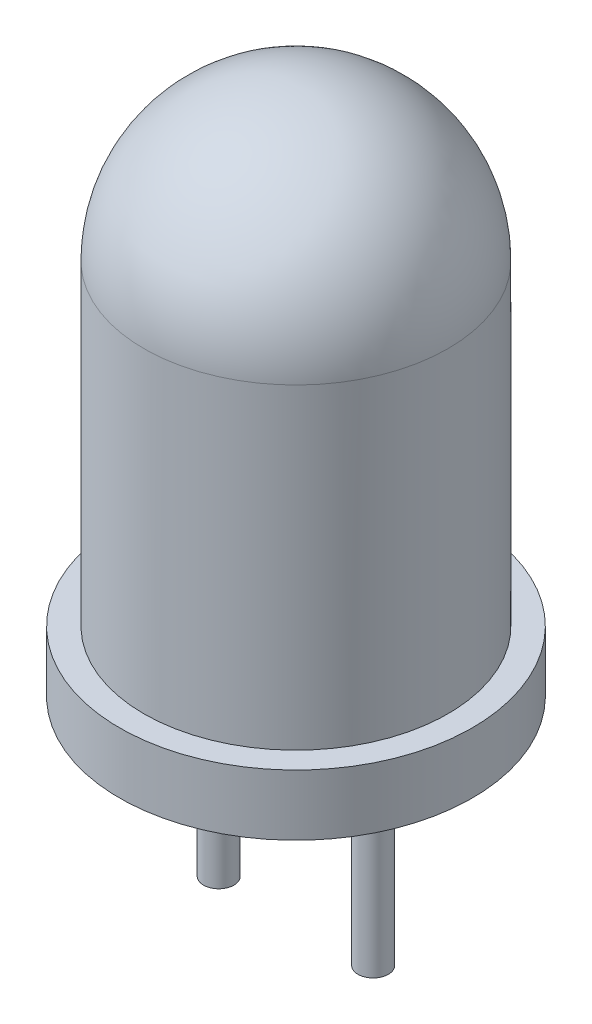
ISO-10303-21;
HEADER;
FILE_DESCRIPTION(('STEP AP214'),'2;1');
FILE_NAME('part.step','',(''),(''),'','','');
FILE_SCHEMA(('AUTOMOTIVE_DESIGN { 1 0 10303 214 1 1 1 1 }'));
ENDSEC;
DATA;
#1=APPLICATION_CONTEXT('core data for automotive mechanical design processes');
#2=APPLICATION_PROTOCOL_DEFINITION('international standard','automotive_design',2000,#1);
#3=PRODUCT_CONTEXT('',#1,'mechanical');
#4=PRODUCT('Part','Part','',(#3));
#5=PRODUCT_RELATED_PRODUCT_CATEGORY('part','',(#4));
#6=PRODUCT_DEFINITION_FORMATION('','',#4);
#7=PRODUCT_DEFINITION_CONTEXT('part definition',#1,'design');
#8=PRODUCT_DEFINITION('design','',#6,#7);
#9=PRODUCT_DEFINITION_SHAPE('','',#8);
#10=(LENGTH_UNIT() NAMED_UNIT(*) SI_UNIT(.MILLI.,.METRE.));
#11=(NAMED_UNIT(*) PLANE_ANGLE_UNIT() SI_UNIT($,.RADIAN.));
#12=(NAMED_UNIT(*) SI_UNIT($,.STERADIAN.) SOLID_ANGLE_UNIT());
#13=UNCERTAINTY_MEASURE_WITH_UNIT(LENGTH_MEASURE(1.E-05),#10,'distance_accuracy_value','');
#14=(GEOMETRIC_REPRESENTATION_CONTEXT(3) GLOBAL_UNCERTAINTY_ASSIGNED_CONTEXT((#13)) GLOBAL_UNIT_ASSIGNED_CONTEXT((#10,
#11,#12)) REPRESENTATION_CONTEXT('',''));
#15=CARTESIAN_POINT('',(0.,0.,0.));
#16=DIRECTION('',(0.,0.,1.));
#17=DIRECTION('',(1.,0.,0.));
#18=AXIS2_PLACEMENT_3D('',#15,#16,#17);
#19=CARTESIAN_POINT('',(0.,6.2,0.));
#20=DIRECTION('',(0.,-1.,0.));
#21=DIRECTION('',(1.,0.,0.));
#22=AXIS2_PLACEMENT_3D('',#19,#20,#21);
#23=SPHERICAL_SURFACE('',#22,2.5);
#24=CARTESIAN_POINT('',(0.,6.20000000000001,0.));
#25=DIRECTION('',(0.,-1.,0.));
#26=DIRECTION('',(0.,0.,-1.));
#27=AXIS2_PLACEMENT_3D('',#24,#25,#26);
#28=CIRCLE('',#27,2.5);
#29=CARTESIAN_POINT('',(0.,6.20000000000001,-2.5));
#30=VERTEX_POINT('',#29);
#31=EDGE_CURVE('E41',#30,#30,#28,.T.);
#32=ORIENTED_EDGE('',*,*,#31,.F.);
#33=EDGE_LOOP('',(#32));
#34=FACE_BOUND('',#33,.T.);
#35=ADVANCED_FACE('F31',(#34),#23,.T.);
#36=CARTESIAN_POINT('',(0.,0.,0.));
#37=DIRECTION('',(0.,-1.,0.));
#38=DIRECTION('',(0.,0.,-1.));
#39=AXIS2_PLACEMENT_3D('',#36,#37,#38);
#40=CYLINDRICAL_SURFACE('',#39,2.5);
#41=ORIENTED_EDGE('',*,*,#31,.T.);
#42=EDGE_LOOP('',(#41));
#43=FACE_BOUND('',#42,.T.);
#44=CARTESIAN_POINT('',(0.,1.,0.));
#45=DIRECTION('',(0.,-1.,0.));
#46=DIRECTION('',(0.,0.,-1.));
#47=AXIS2_PLACEMENT_3D('',#44,#45,#46);
#48=CIRCLE('',#47,2.5);
#49=CARTESIAN_POINT('',(0.,1.,-2.5));
#50=VERTEX_POINT('',#49);
#51=EDGE_CURVE('E45',#50,#50,#48,.T.);
#52=ORIENTED_EDGE('',*,*,#51,.F.);
#53=EDGE_LOOP('',(#52));
#54=FACE_BOUND('',#53,.T.);
#55=ADVANCED_FACE('F75',(#43,#54),#40,.T.);
#56=CARTESIAN_POINT('',(2.5,1.,0.));
#57=DIRECTION('',(0.,1.,0.));
#58=DIRECTION('',(0.,0.,1.));
#59=AXIS2_PLACEMENT_3D('',#56,#57,#58);
#60=PLANE('',#59);
#61=ORIENTED_EDGE('',*,*,#51,.T.);
#62=EDGE_LOOP('',(#61));
#63=FACE_BOUND('',#62,.T.);
#64=CARTESIAN_POINT('',(0.,1.,0.));
#65=DIRECTION('',(0.,-1.,0.));
#66=DIRECTION('',(0.,0.,-1.));
#67=AXIS2_PLACEMENT_3D('',#64,#65,#66);
#68=CIRCLE('',#67,2.9);
#69=CARTESIAN_POINT('',(0.,1.,-2.9));
#70=VERTEX_POINT('',#69);
#71=EDGE_CURVE('E50',#70,#70,#68,.T.);
#72=ORIENTED_EDGE('',*,*,#71,.F.);
#73=EDGE_LOOP('',(#72));
#74=FACE_BOUND('',#73,.T.);
#75=ADVANCED_FACE('F80',(#63,#74),#60,.T.);
#76=CARTESIAN_POINT('',(0.,0.,0.));
#77=DIRECTION('',(0.,-1.,0.));
#78=DIRECTION('',(0.,0.,-1.));
#79=AXIS2_PLACEMENT_3D('',#76,#77,#78);
#80=CYLINDRICAL_SURFACE('',#79,2.9);
#81=ORIENTED_EDGE('',*,*,#71,.T.);
#82=EDGE_LOOP('',(#81));
#83=FACE_BOUND('',#82,.T.);
#84=CARTESIAN_POINT('',(0.,0.,0.));
#85=DIRECTION('',(0.,-1.,0.));
#86=DIRECTION('',(0.,0.,-1.));
#87=AXIS2_PLACEMENT_3D('',#84,#85,#86);
#88=CIRCLE('',#87,2.9);
#89=CARTESIAN_POINT('',(0.,0.,-2.9));
#90=VERTEX_POINT('',#89);
#91=EDGE_CURVE('E53',#90,#90,#88,.T.);
#92=ORIENTED_EDGE('',*,*,#91,.F.);
#93=EDGE_LOOP('',(#92));
#94=FACE_BOUND('',#93,.T.);
#95=ADVANCED_FACE('F88',(#83,#94),#80,.T.);
#96=CARTESIAN_POINT('',(2.9,0.,0.));
#97=DIRECTION('',(0.,-1.,0.));
#98=DIRECTION('',(0.,0.,-1.));
#99=AXIS2_PLACEMENT_3D('',#96,#97,#98);
#100=PLANE('',#99);
#101=CARTESIAN_POINT('',(1.27,0.,0.));
#102=DIRECTION('',(0.,-1.,0.));
#103=DIRECTION('',(0.,0.,-1.));
#104=AXIS2_PLACEMENT_3D('',#101,#102,#103);
#105=CIRCLE('',#104,0.25);
#106=CARTESIAN_POINT('',(1.27,0.,-0.25));
#107=VERTEX_POINT('',#106);
#108=EDGE_CURVE('E10',#107,#107,#105,.T.);
#109=ORIENTED_EDGE('',*,*,#108,.F.);
#110=EDGE_LOOP('',(#109));
#111=FACE_BOUND('',#110,.T.);
#112=CARTESIAN_POINT('',(-1.27,0.,0.));
#113=DIRECTION('',(0.,-1.,0.));
#114=DIRECTION('',(0.,0.,-1.));
#115=AXIS2_PLACEMENT_3D('',#112,#113,#114);
#116=CIRCLE('',#115,0.25);
#117=CARTESIAN_POINT('',(-1.27,0.,-0.25));
#118=VERTEX_POINT('',#117);
#119=EDGE_CURVE('E37',#118,#118,#116,.T.);
#120=ORIENTED_EDGE('',*,*,#119,.F.);
#121=EDGE_LOOP('',(#120));
#122=FACE_BOUND('',#121,.T.);
#123=ORIENTED_EDGE('',*,*,#91,.T.);
#124=EDGE_LOOP('',(#123));
#125=FACE_BOUND('',#124,.T.);
#126=ADVANCED_FACE('F94',(#111,#122,#125),#100,.T.);
#127=CARTESIAN_POINT('',(-1.27,-3.2,0.));
#128=DIRECTION('',(0.,1.,0.));
#129=DIRECTION('',(0.,0.,1.));
#130=AXIS2_PLACEMENT_3D('',#127,#128,#129);
#131=CYLINDRICAL_SURFACE('',#130,0.25);
#132=CARTESIAN_POINT('',(-1.27,-3.2,0.));
#133=DIRECTION('',(0.,1.,0.));
#134=DIRECTION('',(0.,0.,1.));
#135=AXIS2_PLACEMENT_3D('',#132,#133,#134);
#136=CIRCLE('',#135,0.25);
#137=CARTESIAN_POINT('',(-1.27,-3.2,0.25));
#138=VERTEX_POINT('',#137);
#139=EDGE_CURVE('E56',#138,#138,#136,.T.);
#140=ORIENTED_EDGE('',*,*,#139,.T.);
#141=EDGE_LOOP('',(#140));
#142=FACE_BOUND('',#141,.T.);
#143=ORIENTED_EDGE('',*,*,#119,.T.);
#144=EDGE_LOOP('',(#143));
#145=FACE_BOUND('',#144,.T.);
#146=ADVANCED_FACE('F99',(#142,#145),#131,.T.);
#147=CARTESIAN_POINT('',(-1.27,-3.2,0.));
#148=DIRECTION('',(0.,1.,0.));
#149=DIRECTION('',(0.,0.,1.));
#150=AXIS2_PLACEMENT_3D('',#147,#148,#149);
#151=PLANE('',#150);
#152=ORIENTED_EDGE('',*,*,#139,.F.);
#153=EDGE_LOOP('',(#152));
#154=FACE_BOUND('',#153,.T.);
#155=ADVANCED_FACE('F71',(#154),#151,.F.);
#156=CARTESIAN_POINT('',(1.27,-3.2,0.));
#157=DIRECTION('',(0.,1.,0.));
#158=DIRECTION('',(0.,0.,1.));
#159=AXIS2_PLACEMENT_3D('',#156,#157,#158);
#160=CYLINDRICAL_SURFACE('',#159,0.25);
#161=CARTESIAN_POINT('',(1.27,-3.2,0.));
#162=DIRECTION('',(0.,1.,0.));
#163=DIRECTION('',(0.,0.,1.));
#164=AXIS2_PLACEMENT_3D('',#161,#162,#163);
#165=CIRCLE('',#164,0.25);
#166=CARTESIAN_POINT('',(1.27,-3.2,0.249999999999999));
#167=VERTEX_POINT('',#166);
#168=EDGE_CURVE('E59',#167,#167,#165,.T.);
#169=ORIENTED_EDGE('',*,*,#168,.T.);
#170=EDGE_LOOP('',(#169));
#171=FACE_BOUND('',#170,.T.);
#172=ORIENTED_EDGE('',*,*,#108,.T.);
#173=EDGE_LOOP('',(#172));
#174=FACE_BOUND('',#173,.T.);
#175=ADVANCED_FACE('F63',(#171,#174),#160,.T.);
#176=CARTESIAN_POINT('',(1.27,-3.2,0.));
#177=DIRECTION('',(0.,1.,0.));
#178=DIRECTION('',(0.,0.,1.));
#179=AXIS2_PLACEMENT_3D('',#176,#177,#178);
#180=PLANE('',#179);
#181=ORIENTED_EDGE('',*,*,#168,.F.);
#182=EDGE_LOOP('',(#181));
#183=FACE_BOUND('',#182,.T.);
#184=ADVANCED_FACE('F65',(#183),#180,.F.);
#185=CLOSED_SHELL('',(#35,#55,#75,#95,#126,#146,#155,#175,#184));
#186=MANIFOLD_SOLID_BREP('B2',#185);
#187=ADVANCED_BREP_SHAPE_REPRESENTATION('',(#18,#186),#14);
#188=SHAPE_DEFINITION_REPRESENTATION(#9,#187);
ENDSEC;
END-ISO-10303-21;
